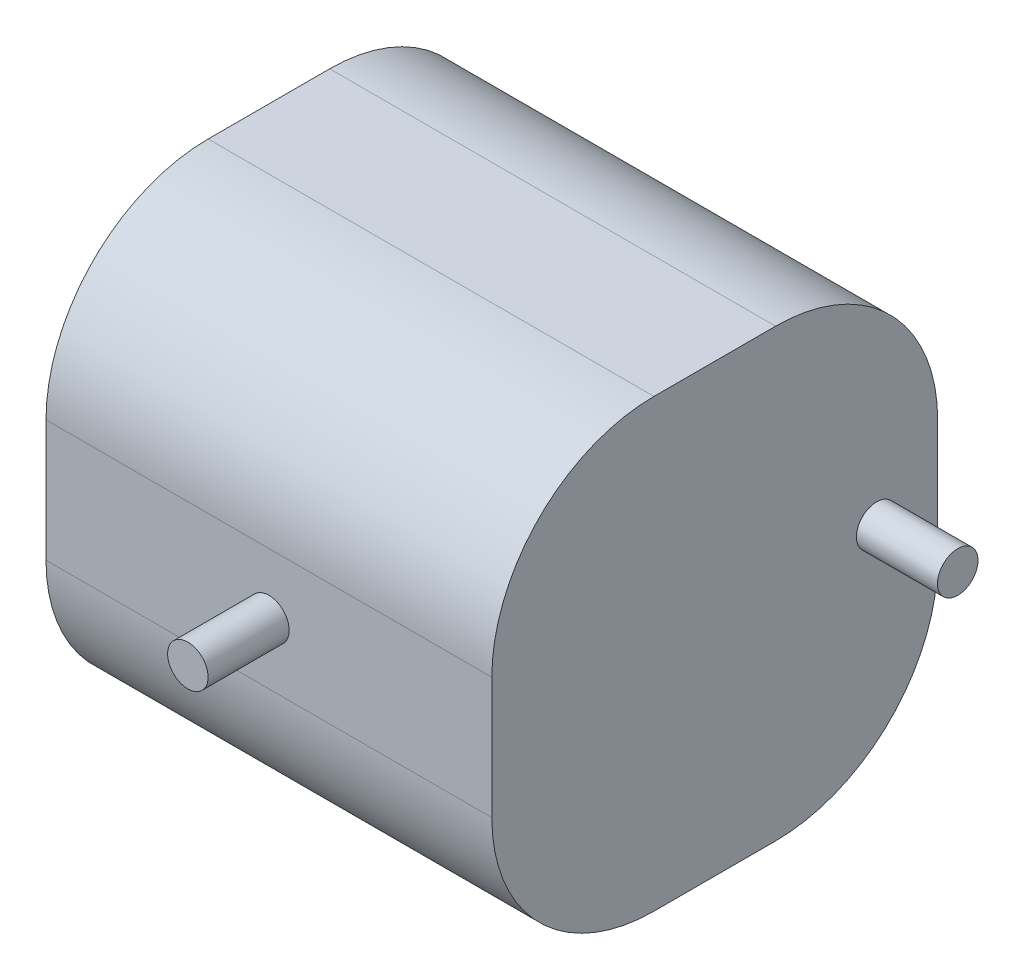
ISO-10303-21;
HEADER;
FILE_DESCRIPTION(('STEP AP214'),'2;1');
FILE_NAME('part.step','',(''),(''),'','','');
FILE_SCHEMA(('AUTOMOTIVE_DESIGN { 1 0 10303 214 1 1 1 1 }'));
ENDSEC;
DATA;
#1=APPLICATION_CONTEXT('core data for automotive mechanical design processes');
#2=APPLICATION_PROTOCOL_DEFINITION('international standard','automotive_design',2000,#1);
#3=PRODUCT_CONTEXT('',#1,'mechanical');
#4=PRODUCT('Part','Part','',(#3));
#5=PRODUCT_RELATED_PRODUCT_CATEGORY('part','',(#4));
#6=PRODUCT_DEFINITION_FORMATION('','',#4);
#7=PRODUCT_DEFINITION_CONTEXT('part definition',#1,'design');
#8=PRODUCT_DEFINITION('design','',#6,#7);
#9=PRODUCT_DEFINITION_SHAPE('','',#8);
#10=(LENGTH_UNIT() NAMED_UNIT(*) SI_UNIT(.MILLI.,.METRE.));
#11=(NAMED_UNIT(*) PLANE_ANGLE_UNIT() SI_UNIT($,.RADIAN.));
#12=(NAMED_UNIT(*) SI_UNIT($,.STERADIAN.) SOLID_ANGLE_UNIT());
#13=UNCERTAINTY_MEASURE_WITH_UNIT(LENGTH_MEASURE(1.E-05),#10,'distance_accuracy_value','');
#14=(GEOMETRIC_REPRESENTATION_CONTEXT(3) GLOBAL_UNCERTAINTY_ASSIGNED_CONTEXT((#13)) GLOBAL_UNIT_ASSIGNED_CONTEXT((#10,
#11,#12)) REPRESENTATION_CONTEXT('',''));
#15=CARTESIAN_POINT('',(0.,0.,0.));
#16=DIRECTION('',(0.,0.,1.));
#17=DIRECTION('',(1.,0.,0.));
#18=AXIS2_PLACEMENT_3D('',#15,#16,#17);
#19=CARTESIAN_POINT('',(-39.0239135912069,32.5401936165715,55.));
#20=DIRECTION('',(1.,0.,0.));
#21=DIRECTION('',(0.,0.,-1.));
#22=AXIS2_PLACEMENT_3D('',#19,#20,#21);
#23=PLANE('',#22);
#24=DIRECTION('',(0.,-1.,0.));
#25=VECTOR('',#24,1.);
#26=CARTESIAN_POINT('',(-39.0239135912069,32.5401936165715,0.));
#27=LINE('',#26,#25);
#28=CARTESIAN_POINT('',(-39.0239135912069,12.5401936165715,0.));
#29=VERTEX_POINT('',#28);
#30=CARTESIAN_POINT('',(-39.0239135912069,-2.45980638342846,0.));
#31=VERTEX_POINT('',#30);
#32=EDGE_CURVE('E167',#29,#31,#27,.T.);
#33=ORIENTED_EDGE('',*,*,#32,.T.);
#34=CARTESIAN_POINT('',(-39.0239135912069,-2.45980638342845,20.));
#35=DIRECTION('',(1.,0.,0.));
#36=DIRECTION('',(0.,0.,-1.));
#37=AXIS2_PLACEMENT_3D('',#34,#35,#36);
#38=CIRCLE('',#37,20.);
#39=CARTESIAN_POINT('',(-39.0239135912069,-22.4598063834285,20.));
#40=VERTEX_POINT('',#39);
#41=EDGE_CURVE('E148',#31,#40,#38,.F.);
#42=ORIENTED_EDGE('',*,*,#41,.T.);
#43=DIRECTION('',(0.,0.,-1.));
#44=VECTOR('',#43,1.);
#45=CARTESIAN_POINT('',(-39.0239135912069,-22.4598063834285,55.));
#46=LINE('',#45,#44);
#47=CARTESIAN_POINT('',(-39.0239135912069,-22.4598063834285,35.));
#48=VERTEX_POINT('',#47);
#49=EDGE_CURVE('E125',#48,#40,#46,.T.);
#50=ORIENTED_EDGE('',*,*,#49,.F.);
#51=CARTESIAN_POINT('',(-39.0239135912069,-2.45980638342845,35.));
#52=DIRECTION('',(1.,0.,0.));
#53=DIRECTION('',(0.,0.,-1.));
#54=AXIS2_PLACEMENT_3D('',#51,#52,#53);
#55=CIRCLE('',#54,20.);
#56=CARTESIAN_POINT('',(-39.0239135912069,-2.45980638342846,55.));
#57=VERTEX_POINT('',#56);
#58=EDGE_CURVE('E130',#48,#57,#55,.F.);
#59=ORIENTED_EDGE('',*,*,#58,.T.);
#60=DIRECTION('',(0.,-1.,0.));
#61=VECTOR('',#60,1.);
#62=CARTESIAN_POINT('',(-39.0239135912069,32.5401936165715,55.));
#63=LINE('',#62,#61);
#64=CARTESIAN_POINT('',(-39.0239135912069,12.5401936165715,55.));
#65=VERTEX_POINT('',#64);
#66=EDGE_CURVE('E166',#65,#57,#63,.T.);
#67=ORIENTED_EDGE('',*,*,#66,.F.);
#68=CARTESIAN_POINT('',(-39.0239135912069,12.5401936165715,35.));
#69=DIRECTION('',(1.,0.,0.));
#70=DIRECTION('',(0.,0.,-1.));
#71=AXIS2_PLACEMENT_3D('',#68,#69,#70);
#72=CIRCLE('',#71,20.);
#73=CARTESIAN_POINT('',(-39.0239135912069,32.5401936165715,35.));
#74=VERTEX_POINT('',#73);
#75=EDGE_CURVE('E59',#65,#74,#72,.F.);
#76=ORIENTED_EDGE('',*,*,#75,.T.);
#77=DIRECTION('',(0.,0.,-1.));
#78=VECTOR('',#77,1.);
#79=CARTESIAN_POINT('',(-39.0239135912069,32.5401936165715,55.));
#80=LINE('',#79,#78);
#81=CARTESIAN_POINT('',(-39.0239135912069,32.5401936165715,20.));
#82=VERTEX_POINT('',#81);
#83=EDGE_CURVE('E157',#74,#82,#80,.T.);
#84=ORIENTED_EDGE('',*,*,#83,.T.);
#85=CARTESIAN_POINT('',(-39.0239135912069,12.5401936165715,20.));
#86=DIRECTION('',(1.,0.,0.));
#87=DIRECTION('',(0.,0.,-1.));
#88=AXIS2_PLACEMENT_3D('',#85,#86,#87);
#89=CIRCLE('',#88,20.);
#90=EDGE_CURVE('E145',#82,#29,#89,.F.);
#91=ORIENTED_EDGE('',*,*,#90,.T.);
#92=EDGE_LOOP('',(#33,#42,#50,#59,#67,#76,#84,#91));
#93=FACE_BOUND('',#92,.T.);
#94=ADVANCED_FACE('F39',(#93),#23,.F.);
#95=CARTESIAN_POINT('',(-39.0239135912069,-22.4598063834285,55.));
#96=DIRECTION('',(0.,1.,0.));
#97=DIRECTION('',(0.,0.,1.));
#98=AXIS2_PLACEMENT_3D('',#95,#96,#97);
#99=PLANE('',#98);
#100=ORIENTED_EDGE('',*,*,#49,.T.);
#101=DIRECTION('',(1.,0.,0.));
#102=VECTOR('',#101,1.);
#103=CARTESIAN_POINT('',(-39.0239135912069,-22.4598063834285,20.));
#104=LINE('',#103,#102);
#105=CARTESIAN_POINT('',(15.9760864087931,-22.4598063834285,20.));
#106=VERTEX_POINT('',#105);
#107=EDGE_CURVE('E124',#40,#106,#104,.T.);
#108=ORIENTED_EDGE('',*,*,#107,.T.);
#109=DIRECTION('',(0.,0.,-1.));
#110=VECTOR('',#109,1.);
#111=CARTESIAN_POINT('',(15.9760864087931,-22.4598063834285,55.));
#112=LINE('',#111,#110);
#113=CARTESIAN_POINT('',(15.9760864087931,-22.4598063834285,35.));
#114=VERTEX_POINT('',#113);
#115=EDGE_CURVE('E107',#114,#106,#112,.T.);
#116=ORIENTED_EDGE('',*,*,#115,.F.);
#117=DIRECTION('',(1.,0.,0.));
#118=VECTOR('',#117,1.);
#119=CARTESIAN_POINT('',(-39.0239135912069,-22.4598063834285,35.));
#120=LINE('',#119,#118);
#121=EDGE_CURVE('E121',#114,#48,#120,.F.);
#122=ORIENTED_EDGE('',*,*,#121,.T.);
#123=EDGE_LOOP('',(#100,#108,#116,#122));
#124=FACE_BOUND('',#123,.T.);
#125=ADVANCED_FACE('F120',(#124),#99,.F.);
#126=CARTESIAN_POINT('',(15.9760864087931,32.5401936165715,55.));
#127=DIRECTION('',(1.,0.,0.));
#128=DIRECTION('',(0.,1.,0.));
#129=AXIS2_PLACEMENT_3D('',#126,#127,#128);
#130=PLANE('',#129);
#131=CARTESIAN_POINT('',(15.9760864087931,5.04019361657154,7.52358163117587));
#132=DIRECTION('',(1.,0.,0.));
#133=DIRECTION('',(0.,1.,0.));
#134=AXIS2_PLACEMENT_3D('',#131,#132,#133);
#135=CIRCLE('',#134,2.5);
#136=CARTESIAN_POINT('',(15.9760864087931,7.54019361657154,7.52358163117587));
#137=VERTEX_POINT('',#136);
#138=EDGE_CURVE('E174',#137,#137,#135,.T.);
#139=ORIENTED_EDGE('',*,*,#138,.F.);
#140=EDGE_LOOP('',(#139));
#141=FACE_BOUND('',#140,.T.);
#142=ORIENTED_EDGE('',*,*,#115,.T.);
#143=CARTESIAN_POINT('',(15.9760864087931,-2.45980638342845,20.));
#144=DIRECTION('',(1.,0.,0.));
#145=DIRECTION('',(0.,1.,0.));
#146=AXIS2_PLACEMENT_3D('',#143,#144,#145);
#147=CIRCLE('',#146,20.);
#148=CARTESIAN_POINT('',(15.9760864087931,-2.45980638342846,0.));
#149=VERTEX_POINT('',#148);
#150=EDGE_CURVE('E114',#106,#149,#147,.T.);
#151=ORIENTED_EDGE('',*,*,#150,.T.);
#152=DIRECTION('',(0.,-1.,0.));
#153=VECTOR('',#152,1.);
#154=CARTESIAN_POINT('',(15.9760864087931,32.5401936165715,0.));
#155=LINE('',#154,#153);
#156=CARTESIAN_POINT('',(15.9760864087931,12.5401936165715,0.));
#157=VERTEX_POINT('',#156);
#158=EDGE_CURVE('E163',#157,#149,#155,.T.);
#159=ORIENTED_EDGE('',*,*,#158,.F.);
#160=CARTESIAN_POINT('',(15.9760864087931,12.5401936165715,20.));
#161=DIRECTION('',(1.,0.,0.));
#162=DIRECTION('',(0.,1.,0.));
#163=AXIS2_PLACEMENT_3D('',#160,#161,#162);
#164=CIRCLE('',#163,20.);
#165=CARTESIAN_POINT('',(15.9760864087931,32.5401936165715,20.));
#166=VERTEX_POINT('',#165);
#167=EDGE_CURVE('E115',#157,#166,#164,.T.);
#168=ORIENTED_EDGE('',*,*,#167,.T.);
#169=DIRECTION('',(0.,0.,-1.));
#170=VECTOR('',#169,1.);
#171=CARTESIAN_POINT('',(15.9760864087931,32.5401936165715,55.));
#172=LINE('',#171,#170);
#173=CARTESIAN_POINT('',(15.9760864087931,32.5401936165715,35.));
#174=VERTEX_POINT('',#173);
#175=EDGE_CURVE('E126',#174,#166,#172,.T.);
#176=ORIENTED_EDGE('',*,*,#175,.F.);
#177=CARTESIAN_POINT('',(15.9760864087931,12.5401936165715,35.));
#178=DIRECTION('',(1.,0.,0.));
#179=DIRECTION('',(0.,1.,0.));
#180=AXIS2_PLACEMENT_3D('',#177,#178,#179);
#181=CIRCLE('',#180,20.);
#182=CARTESIAN_POINT('',(15.9760864087931,12.5401936165715,55.));
#183=VERTEX_POINT('',#182);
#184=EDGE_CURVE('E132',#174,#183,#181,.T.);
#185=ORIENTED_EDGE('',*,*,#184,.T.);
#186=DIRECTION('',(0.,-1.,0.));
#187=VECTOR('',#186,1.);
#188=CARTESIAN_POINT('',(15.9760864087931,32.5401936165715,55.));
#189=LINE('',#188,#187);
#190=CARTESIAN_POINT('',(15.9760864087931,-2.45980638342846,55.));
#191=VERTEX_POINT('',#190);
#192=EDGE_CURVE('E109',#183,#191,#189,.T.);
#193=ORIENTED_EDGE('',*,*,#192,.T.);
#194=CARTESIAN_POINT('',(15.9760864087931,-2.45980638342845,35.));
#195=DIRECTION('',(1.,0.,0.));
#196=DIRECTION('',(0.,1.,0.));
#197=AXIS2_PLACEMENT_3D('',#194,#195,#196);
#198=CIRCLE('',#197,20.);
#199=EDGE_CURVE('E104',#191,#114,#198,.T.);
#200=ORIENTED_EDGE('',*,*,#199,.T.);
#201=EDGE_LOOP('',(#142,#151,#159,#168,#176,#185,#193,#200));
#202=FACE_BOUND('',#201,.T.);
#203=ADVANCED_FACE('F106',(#141,#202),#130,.T.);
#204=CARTESIAN_POINT('',(-39.0239135912069,32.5401936165715,55.));
#205=DIRECTION('',(0.,1.,0.));
#206=DIRECTION('',(0.,0.,1.));
#207=AXIS2_PLACEMENT_3D('',#204,#205,#206);
#208=PLANE('',#207);
#209=ORIENTED_EDGE('',*,*,#175,.T.);
#210=DIRECTION('',(1.,0.,0.));
#211=VECTOR('',#210,1.);
#212=CARTESIAN_POINT('',(-39.0239135912069,32.5401936165715,20.));
#213=LINE('',#212,#211);
#214=EDGE_CURVE('E11',#166,#82,#213,.F.);
#215=ORIENTED_EDGE('',*,*,#214,.T.);
#216=ORIENTED_EDGE('',*,*,#83,.F.);
#217=DIRECTION('',(1.,0.,0.));
#218=VECTOR('',#217,1.);
#219=CARTESIAN_POINT('',(-39.0239135912069,32.5401936165715,35.));
#220=LINE('',#219,#218);
#221=EDGE_CURVE('E47',#74,#174,#220,.T.);
#222=ORIENTED_EDGE('',*,*,#221,.T.);
#223=EDGE_LOOP('',(#209,#215,#216,#222));
#224=FACE_BOUND('',#223,.T.);
#225=ADVANCED_FACE('F156',(#224),#208,.T.);
#226=CARTESIAN_POINT('',(0.,0.,55.));
#227=DIRECTION('',(0.,0.,1.));
#228=DIRECTION('',(1.,0.,0.));
#229=AXIS2_PLACEMENT_3D('',#226,#227,#228);
#230=PLANE('',#229);
#231=CARTESIAN_POINT('',(-11.5239135912069,5.04019361657154,55.));
#232=DIRECTION('',(0.,0.,1.));
#233=DIRECTION('',(1.,0.,0.));
#234=AXIS2_PLACEMENT_3D('',#231,#232,#233);
#235=CIRCLE('',#234,2.5);
#236=CARTESIAN_POINT('',(-9.02391359120693,5.04019361657154,55.));
#237=VERTEX_POINT('',#236);
#238=EDGE_CURVE('E180',#237,#237,#235,.T.);
#239=ORIENTED_EDGE('',*,*,#238,.F.);
#240=EDGE_LOOP('',(#239));
#241=FACE_BOUND('',#240,.T.);
#242=ORIENTED_EDGE('',*,*,#66,.T.);
#243=DIRECTION('',(1.,0.,0.));
#244=VECTOR('',#243,1.);
#245=CARTESIAN_POINT('',(15.9760864087931,-2.45980638342845,55.));
#246=LINE('',#245,#244);
#247=EDGE_CURVE('E152',#57,#191,#246,.T.);
#248=ORIENTED_EDGE('',*,*,#247,.T.);
#249=ORIENTED_EDGE('',*,*,#192,.F.);
#250=DIRECTION('',(1.,0.,0.));
#251=VECTOR('',#250,1.);
#252=CARTESIAN_POINT('',(0.,12.5401936165715,55.));
#253=LINE('',#252,#251);
#254=EDGE_CURVE('E150',#183,#65,#253,.F.);
#255=ORIENTED_EDGE('',*,*,#254,.T.);
#256=EDGE_LOOP('',(#242,#248,#249,#255));
#257=FACE_BOUND('',#256,.T.);
#258=ADVANCED_FACE('F195',(#241,#257),#230,.T.);
#259=CARTESIAN_POINT('',(0.,0.,0.));
#260=DIRECTION('',(0.,0.,1.));
#261=DIRECTION('',(1.,0.,0.));
#262=AXIS2_PLACEMENT_3D('',#259,#260,#261);
#263=PLANE('',#262);
#264=ORIENTED_EDGE('',*,*,#158,.T.);
#265=DIRECTION('',(1.,0.,0.));
#266=VECTOR('',#265,1.);
#267=CARTESIAN_POINT('',(0.,-2.45980638342845,0.));
#268=LINE('',#267,#266);
#269=EDGE_CURVE('E142',#149,#31,#268,.F.);
#270=ORIENTED_EDGE('',*,*,#269,.T.);
#271=ORIENTED_EDGE('',*,*,#32,.F.);
#272=DIRECTION('',(1.,0.,0.));
#273=VECTOR('',#272,1.);
#274=CARTESIAN_POINT('',(15.9760864087931,12.5401936165715,0.));
#275=LINE('',#274,#273);
#276=EDGE_CURVE('E139',#29,#157,#275,.T.);
#277=ORIENTED_EDGE('',*,*,#276,.T.);
#278=EDGE_LOOP('',(#264,#270,#271,#277));
#279=FACE_BOUND('',#278,.T.);
#280=ADVANCED_FACE('F198',(#279),#263,.F.);
#281=CARTESIAN_POINT('',(25.9760864087931,5.04019361657154,7.52358163117587));
#282=DIRECTION('',(-1.,0.,0.));
#283=DIRECTION('',(0.,-1.,0.));
#284=AXIS2_PLACEMENT_3D('',#281,#282,#283);
#285=CYLINDRICAL_SURFACE('',#284,2.5);
#286=CARTESIAN_POINT('',(25.9760864087931,5.04019361657154,7.52358163117587));
#287=DIRECTION('',(1.,0.,0.));
#288=DIRECTION('',(0.,1.,0.));
#289=AXIS2_PLACEMENT_3D('',#286,#287,#288);
#290=CIRCLE('',#289,2.5);
#291=CARTESIAN_POINT('',(25.9760864087931,7.54019361657155,7.52358163117587));
#292=VERTEX_POINT('',#291);
#293=EDGE_CURVE('E170',#292,#292,#290,.T.);
#294=ORIENTED_EDGE('',*,*,#293,.F.);
#295=EDGE_LOOP('',(#294));
#296=FACE_BOUND('',#295,.T.);
#297=ORIENTED_EDGE('',*,*,#138,.T.);
#298=EDGE_LOOP('',(#297));
#299=FACE_BOUND('',#298,.T.);
#300=ADVANCED_FACE('F261',(#296,#299),#285,.T.);
#301=CARTESIAN_POINT('',(25.9760864087931,5.04019361657154,7.52358163117587));
#302=DIRECTION('',(1.,0.,0.));
#303=DIRECTION('',(0.,1.,0.));
#304=AXIS2_PLACEMENT_3D('',#301,#302,#303);
#305=PLANE('',#304);
#306=ORIENTED_EDGE('',*,*,#293,.T.);
#307=EDGE_LOOP('',(#306));
#308=FACE_BOUND('',#307,.T.);
#309=ADVANCED_FACE('F191',(#308),#305,.T.);
#310=CARTESIAN_POINT('',(-11.5239135912069,5.04019361657154,65.));
#311=DIRECTION('',(0.,0.,-1.));
#312=DIRECTION('',(-1.,0.,0.));
#313=AXIS2_PLACEMENT_3D('',#310,#311,#312);
#314=CYLINDRICAL_SURFACE('',#313,2.5);
#315=CARTESIAN_POINT('',(-11.5239135912069,5.04019361657154,65.));
#316=DIRECTION('',(0.,0.,1.));
#317=DIRECTION('',(1.,0.,0.));
#318=AXIS2_PLACEMENT_3D('',#315,#316,#317);
#319=CIRCLE('',#318,2.5);
#320=CARTESIAN_POINT('',(-9.02391359120693,5.04019361657154,65.));
#321=VERTEX_POINT('',#320);
#322=EDGE_CURVE('E177',#321,#321,#319,.T.);
#323=ORIENTED_EDGE('',*,*,#322,.F.);
#324=EDGE_LOOP('',(#323));
#325=FACE_BOUND('',#324,.T.);
#326=ORIENTED_EDGE('',*,*,#238,.T.);
#327=EDGE_LOOP('',(#326));
#328=FACE_BOUND('',#327,.T.);
#329=ADVANCED_FACE('F188',(#325,#328),#314,.T.);
#330=CARTESIAN_POINT('',(-11.5239135912069,5.04019361657154,65.));
#331=DIRECTION('',(0.,0.,1.));
#332=DIRECTION('',(1.,0.,0.));
#333=AXIS2_PLACEMENT_3D('',#330,#331,#332);
#334=PLANE('',#333);
#335=ORIENTED_EDGE('',*,*,#322,.T.);
#336=EDGE_LOOP('',(#335));
#337=FACE_BOUND('',#336,.T.);
#338=ADVANCED_FACE('F186',(#337),#334,.T.);
#339=CARTESIAN_POINT('',(-39.0239135912069,-2.45980638342845,20.));
#340=DIRECTION('',(1.,0.,0.));
#341=DIRECTION('',(0.,0.,-1.));
#342=AXIS2_PLACEMENT_3D('',#339,#340,#341);
#343=CYLINDRICAL_SURFACE('',#342,20.);
#344=ORIENTED_EDGE('',*,*,#41,.F.);
#345=ORIENTED_EDGE('',*,*,#269,.F.);
#346=ORIENTED_EDGE('',*,*,#150,.F.);
#347=ORIENTED_EDGE('',*,*,#107,.F.);
#348=EDGE_LOOP('',(#344,#345,#346,#347));
#349=FACE_BOUND('',#348,.T.);
#350=ADVANCED_FACE('F215',(#349),#343,.T.);
#351=CARTESIAN_POINT('',(0.,-2.45980638342845,35.));
#352=DIRECTION('',(-1.,0.,0.));
#353=DIRECTION('',(0.,0.,1.));
#354=AXIS2_PLACEMENT_3D('',#351,#352,#353);
#355=CYLINDRICAL_SURFACE('',#354,20.);
#356=ORIENTED_EDGE('',*,*,#58,.F.);
#357=ORIENTED_EDGE('',*,*,#121,.F.);
#358=ORIENTED_EDGE('',*,*,#199,.F.);
#359=ORIENTED_EDGE('',*,*,#247,.F.);
#360=EDGE_LOOP('',(#356,#357,#358,#359));
#361=FACE_BOUND('',#360,.T.);
#362=ADVANCED_FACE('F129',(#361),#355,.T.);
#363=CARTESIAN_POINT('',(0.,12.5401936165715,20.));
#364=DIRECTION('',(-1.,0.,0.));
#365=DIRECTION('',(0.,0.,1.));
#366=AXIS2_PLACEMENT_3D('',#363,#364,#365);
#367=CYLINDRICAL_SURFACE('',#366,20.);
#368=ORIENTED_EDGE('',*,*,#90,.F.);
#369=ORIENTED_EDGE('',*,*,#214,.F.);
#370=ORIENTED_EDGE('',*,*,#167,.F.);
#371=ORIENTED_EDGE('',*,*,#276,.F.);
#372=EDGE_LOOP('',(#368,#369,#370,#371));
#373=FACE_BOUND('',#372,.T.);
#374=ADVANCED_FACE('F202',(#373),#367,.T.);
#375=CARTESIAN_POINT('',(-39.0239135912069,12.5401936165715,35.));
#376=DIRECTION('',(1.,0.,0.));
#377=DIRECTION('',(0.,0.,-1.));
#378=AXIS2_PLACEMENT_3D('',#375,#376,#377);
#379=CYLINDRICAL_SURFACE('',#378,20.);
#380=ORIENTED_EDGE('',*,*,#75,.F.);
#381=ORIENTED_EDGE('',*,*,#254,.F.);
#382=ORIENTED_EDGE('',*,*,#184,.F.);
#383=ORIENTED_EDGE('',*,*,#221,.F.);
#384=EDGE_LOOP('',(#380,#381,#382,#383));
#385=FACE_BOUND('',#384,.T.);
#386=ADVANCED_FACE('F41',(#385),#379,.T.);
#387=CLOSED_SHELL('',(#94,#125,#203,#225,#258,#280,#300,#309,#329,#338,#350,#362,#374,#386));
#388=MANIFOLD_SOLID_BREP('B2',#387);
#389=ADVANCED_BREP_SHAPE_REPRESENTATION('',(#18,#388),#14);
#390=SHAPE_DEFINITION_REPRESENTATION(#9,#389);
ENDSEC;
END-ISO-10303-21;
